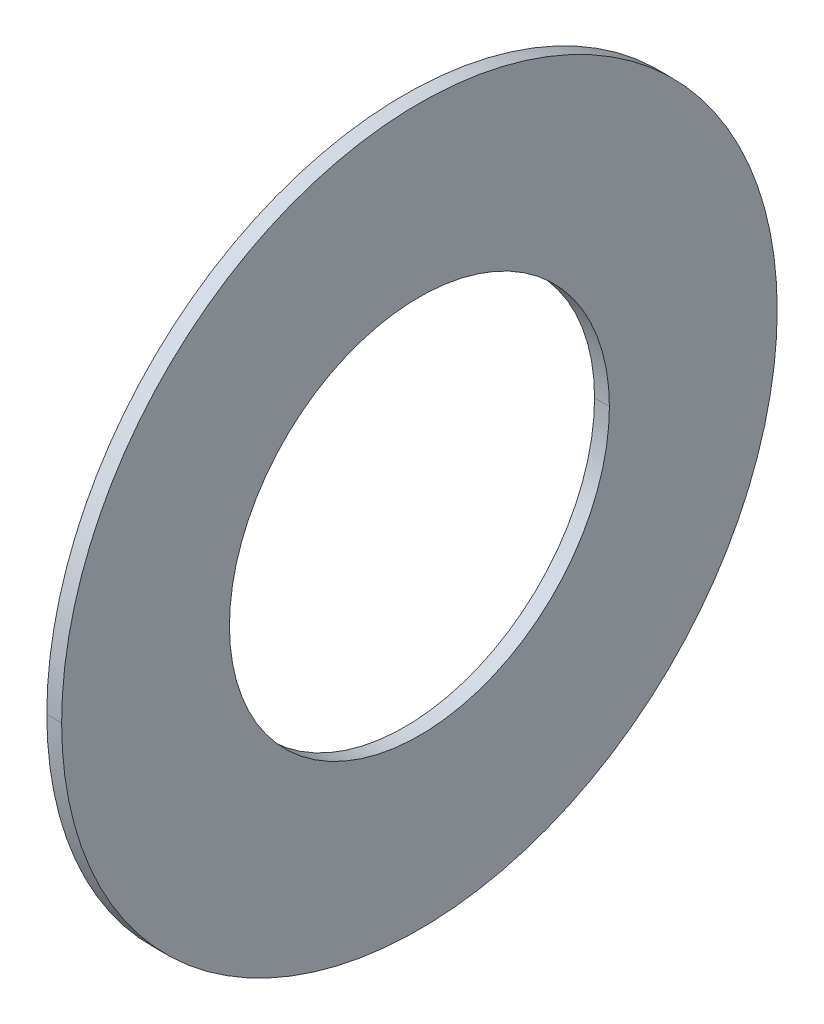
ISO-10303-21;
HEADER;
FILE_DESCRIPTION(('STEP AP214'),'2;1');
FILE_NAME('part.step','',(''),(''),'','','');
FILE_SCHEMA(('AUTOMOTIVE_DESIGN { 1 0 10303 214 1 1 1 1 }'));
ENDSEC;
DATA;
#1=APPLICATION_CONTEXT('core data for automotive mechanical design processes');
#2=APPLICATION_PROTOCOL_DEFINITION('international standard','automotive_design',2000,#1);
#3=PRODUCT_CONTEXT('',#1,'mechanical');
#4=PRODUCT('Part','Part','',(#3));
#5=PRODUCT_RELATED_PRODUCT_CATEGORY('part','',(#4));
#6=PRODUCT_DEFINITION_FORMATION('','',#4);
#7=PRODUCT_DEFINITION_CONTEXT('part definition',#1,'design');
#8=PRODUCT_DEFINITION('design','',#6,#7);
#9=PRODUCT_DEFINITION_SHAPE('','',#8);
#10=(LENGTH_UNIT() NAMED_UNIT(*) SI_UNIT(.MILLI.,.METRE.));
#11=(NAMED_UNIT(*) PLANE_ANGLE_UNIT() SI_UNIT($,.RADIAN.));
#12=(NAMED_UNIT(*) SI_UNIT($,.STERADIAN.) SOLID_ANGLE_UNIT());
#13=UNCERTAINTY_MEASURE_WITH_UNIT(LENGTH_MEASURE(1.E-05),#10,'distance_accuracy_value','');
#14=(GEOMETRIC_REPRESENTATION_CONTEXT(3) GLOBAL_UNCERTAINTY_ASSIGNED_CONTEXT((#13)) GLOBAL_UNIT_ASSIGNED_CONTEXT((#10,
#11,#12)) REPRESENTATION_CONTEXT('',''));
#15=CARTESIAN_POINT('',(0.,0.,0.));
#16=DIRECTION('',(0.,0.,1.));
#17=DIRECTION('',(1.,0.,0.));
#18=AXIS2_PLACEMENT_3D('',#15,#16,#17);
#19=CARTESIAN_POINT('',(0.3125,5.65,0.));
#20=DIRECTION('',(-1.,0.,0.));
#21=DIRECTION('',(0.,0.,1.));
#22=AXIS2_PLACEMENT_3D('',#19,#20,#21);
#23=PLANE('',#22);
#24=CARTESIAN_POINT('',(0.3125,0.,0.));
#25=DIRECTION('',(1.,0.,0.));
#26=DIRECTION('',(0.,0.,-1.));
#27=AXIS2_PLACEMENT_3D('',#24,#25,#26);
#28=CIRCLE('',#27,3.);
#29=CARTESIAN_POINT('',(0.3125,0.,-3.));
#30=VERTEX_POINT('',#29);
#31=CARTESIAN_POINT('',(0.3125,0.,3.));
#32=VERTEX_POINT('',#31);
#33=EDGE_CURVE('E11',#30,#32,#28,.T.);
#34=ORIENTED_EDGE('',*,*,#33,.T.);
#35=CARTESIAN_POINT('',(0.3125,0.,0.));
#36=DIRECTION('',(1.,0.,0.));
#37=DIRECTION('',(0.,0.,-1.));
#38=AXIS2_PLACEMENT_3D('',#35,#36,#37);
#39=CIRCLE('',#38,3.);
#40=EDGE_CURVE('E25',#32,#30,#39,.T.);
#41=ORIENTED_EDGE('',*,*,#40,.T.);
#42=EDGE_LOOP('',(#34,#41));
#43=FACE_BOUND('',#42,.T.);
#44=CARTESIAN_POINT('',(0.3125,0.,0.));
#45=DIRECTION('',(1.,0.,0.));
#46=DIRECTION('',(0.,0.,-1.));
#47=AXIS2_PLACEMENT_3D('',#44,#45,#46);
#48=CIRCLE('',#47,5.65);
#49=CARTESIAN_POINT('',(0.3125,0.,-5.65));
#50=VERTEX_POINT('',#49);
#51=CARTESIAN_POINT('',(0.3125,0.,5.65));
#52=VERTEX_POINT('',#51);
#53=EDGE_CURVE('E96',#50,#52,#48,.T.);
#54=ORIENTED_EDGE('',*,*,#53,.F.);
#55=CARTESIAN_POINT('',(0.3125,0.,0.));
#56=DIRECTION('',(1.,0.,0.));
#57=DIRECTION('',(0.,0.,-1.));
#58=AXIS2_PLACEMENT_3D('',#55,#56,#57);
#59=CIRCLE('',#58,5.65);
#60=EDGE_CURVE('E91',#52,#50,#59,.T.);
#61=ORIENTED_EDGE('',*,*,#60,.F.);
#62=EDGE_LOOP('',(#54,#61));
#63=FACE_BOUND('',#62,.T.);
#64=ADVANCED_FACE('F17',(#43,#63),#23,.T.);
#65=CARTESIAN_POINT('',(0.54675,0.,0.));
#66=DIRECTION('',(-1.,0.,0.));
#67=DIRECTION('',(0.,1.,0.));
#68=AXIS2_PLACEMENT_3D('',#65,#66,#67);
#69=CYLINDRICAL_SURFACE('',#68,5.65);
#70=ORIENTED_EDGE('',*,*,#60,.T.);
#71=DIRECTION('',(-1.,0.,0.));
#72=VECTOR('',#71,1.);
#73=CARTESIAN_POINT('',(0.54675,0.,-5.65));
#74=LINE('',#73,#72);
#75=CARTESIAN_POINT('',(0.54675,0.,-5.65));
#76=VERTEX_POINT('',#75);
#77=EDGE_CURVE('E86',#76,#50,#74,.T.);
#78=ORIENTED_EDGE('',*,*,#77,.F.);
#79=CARTESIAN_POINT('',(0.54675,0.,0.));
#80=DIRECTION('',(1.,0.,0.));
#81=DIRECTION('',(0.,0.,-1.));
#82=AXIS2_PLACEMENT_3D('',#79,#80,#81);
#83=CIRCLE('',#82,5.65);
#84=CARTESIAN_POINT('',(0.54675,0.,5.65));
#85=VERTEX_POINT('',#84);
#86=EDGE_CURVE('E81',#85,#76,#83,.T.);
#87=ORIENTED_EDGE('',*,*,#86,.F.);
#88=DIRECTION('',(-1.,0.,0.));
#89=VECTOR('',#88,1.);
#90=CARTESIAN_POINT('',(0.54675,0.,5.65));
#91=LINE('',#90,#89);
#92=EDGE_CURVE('E70',#85,#52,#91,.T.);
#93=ORIENTED_EDGE('',*,*,#92,.T.);
#94=EDGE_LOOP('',(#70,#78,#87,#93));
#95=FACE_BOUND('',#94,.T.);
#96=ADVANCED_FACE('F111',(#95),#69,.T.);
#97=CARTESIAN_POINT('',(0.54675,0.,0.));
#98=DIRECTION('',(-1.,0.,0.));
#99=DIRECTION('',(0.,-1.,0.));
#100=AXIS2_PLACEMENT_3D('',#97,#98,#99);
#101=CYLINDRICAL_SURFACE('',#100,5.65);
#102=CARTESIAN_POINT('',(0.54675,0.,0.));
#103=DIRECTION('',(1.,0.,0.));
#104=DIRECTION('',(0.,0.,-1.));
#105=AXIS2_PLACEMENT_3D('',#102,#103,#104);
#106=CIRCLE('',#105,5.65);
#107=EDGE_CURVE('E67',#76,#85,#106,.T.);
#108=ORIENTED_EDGE('',*,*,#107,.F.);
#109=ORIENTED_EDGE('',*,*,#77,.T.);
#110=ORIENTED_EDGE('',*,*,#53,.T.);
#111=ORIENTED_EDGE('',*,*,#92,.F.);
#112=EDGE_LOOP('',(#108,#109,#110,#111));
#113=FACE_BOUND('',#112,.T.);
#114=ADVANCED_FACE('F108',(#113),#101,.T.);
#115=CARTESIAN_POINT('',(0.54675,3.,0.));
#116=DIRECTION('',(1.,0.,0.));
#117=DIRECTION('',(0.,0.,-1.));
#118=AXIS2_PLACEMENT_3D('',#115,#116,#117);
#119=PLANE('',#118);
#120=ORIENTED_EDGE('',*,*,#107,.T.);
#121=ORIENTED_EDGE('',*,*,#86,.T.);
#122=EDGE_LOOP('',(#120,#121));
#123=FACE_BOUND('',#122,.T.);
#124=CARTESIAN_POINT('',(0.54675,0.,0.));
#125=DIRECTION('',(1.,0.,0.));
#126=DIRECTION('',(0.,0.,-1.));
#127=AXIS2_PLACEMENT_3D('',#124,#125,#126);
#128=CIRCLE('',#127,3.);
#129=CARTESIAN_POINT('',(0.54675,0.,-3.));
#130=VERTEX_POINT('',#129);
#131=CARTESIAN_POINT('',(0.54675,0.,3.));
#132=VERTEX_POINT('',#131);
#133=EDGE_CURVE('E56',#130,#132,#128,.T.);
#134=ORIENTED_EDGE('',*,*,#133,.F.);
#135=CARTESIAN_POINT('',(0.54675,0.,0.));
#136=DIRECTION('',(1.,0.,0.));
#137=DIRECTION('',(0.,0.,-1.));
#138=AXIS2_PLACEMENT_3D('',#135,#136,#137);
#139=CIRCLE('',#138,3.);
#140=EDGE_CURVE('E52',#132,#130,#139,.T.);
#141=ORIENTED_EDGE('',*,*,#140,.F.);
#142=EDGE_LOOP('',(#134,#141));
#143=FACE_BOUND('',#142,.T.);
#144=ADVANCED_FACE('F54',(#123,#143),#119,.T.);
#145=CARTESIAN_POINT('',(0.54675,0.,0.));
#146=DIRECTION('',(-1.,0.,0.));
#147=DIRECTION('',(0.,1.,0.));
#148=AXIS2_PLACEMENT_3D('',#145,#146,#147);
#149=CYLINDRICAL_SURFACE('',#148,3.);
#150=ORIENTED_EDGE('',*,*,#40,.F.);
#151=DIRECTION('',(-1.,0.,0.));
#152=VECTOR('',#151,1.);
#153=CARTESIAN_POINT('',(0.54675,0.,3.));
#154=LINE('',#153,#152);
#155=EDGE_CURVE('E59',#132,#32,#154,.T.);
#156=ORIENTED_EDGE('',*,*,#155,.F.);
#157=ORIENTED_EDGE('',*,*,#140,.T.);
#158=DIRECTION('',(-1.,0.,0.));
#159=VECTOR('',#158,1.);
#160=CARTESIAN_POINT('',(0.54675,0.,-3.));
#161=LINE('',#160,#159);
#162=EDGE_CURVE('E64',#130,#30,#161,.T.);
#163=ORIENTED_EDGE('',*,*,#162,.T.);
#164=EDGE_LOOP('',(#150,#156,#157,#163));
#165=FACE_BOUND('',#164,.T.);
#166=ADVANCED_FACE('F62',(#165),#149,.F.);
#167=CARTESIAN_POINT('',(0.54675,0.,0.));
#168=DIRECTION('',(-1.,0.,0.));
#169=DIRECTION('',(0.,-1.,0.));
#170=AXIS2_PLACEMENT_3D('',#167,#168,#169);
#171=CYLINDRICAL_SURFACE('',#170,3.);
#172=ORIENTED_EDGE('',*,*,#133,.T.);
#173=ORIENTED_EDGE('',*,*,#155,.T.);
#174=ORIENTED_EDGE('',*,*,#33,.F.);
#175=ORIENTED_EDGE('',*,*,#162,.F.);
#176=EDGE_LOOP('',(#172,#173,#174,#175));
#177=FACE_BOUND('',#176,.T.);
#178=ADVANCED_FACE('F66',(#177),#171,.F.);
#179=CLOSED_SHELL('',(#64,#96,#114,#144,#166,#178));
#180=MANIFOLD_SOLID_BREP('B1',#179);
#181=ADVANCED_BREP_SHAPE_REPRESENTATION('',(#18,#180),#14);
#182=SHAPE_DEFINITION_REPRESENTATION(#9,#181);
ENDSEC;
END-ISO-10303-21;
